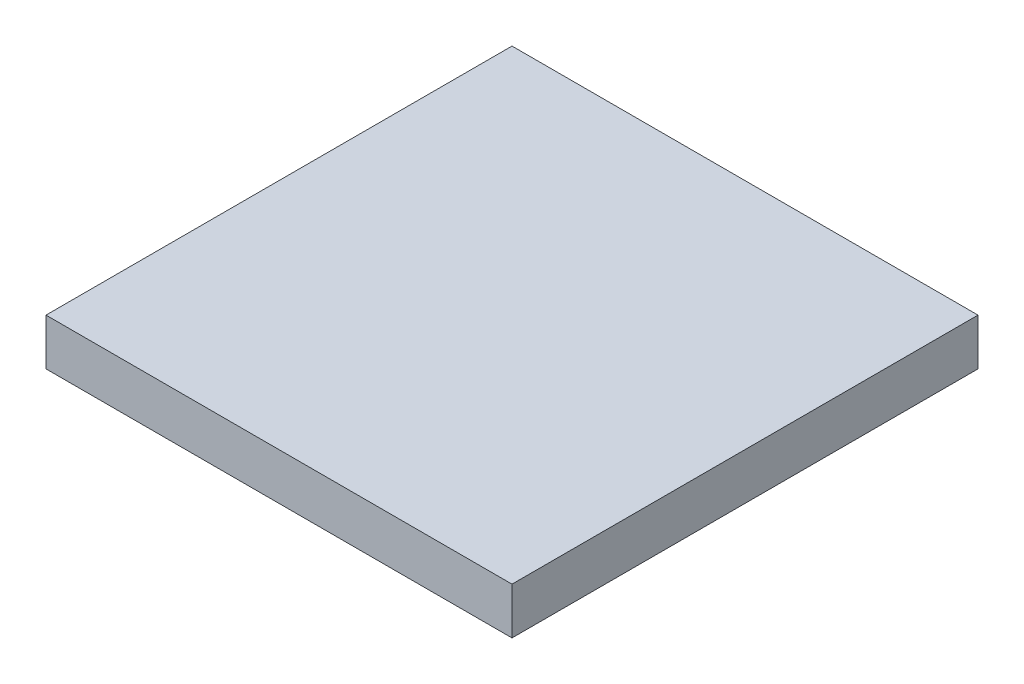
ISO-10303-21;
HEADER;
FILE_DESCRIPTION(('STEP AP214'),'2;1');
FILE_NAME('part.step','',(''),(''),'','','');
FILE_SCHEMA(('AUTOMOTIVE_DESIGN { 1 0 10303 214 1 1 1 1 }'));
ENDSEC;
DATA;
#1=APPLICATION_CONTEXT('core data for automotive mechanical design processes');
#2=APPLICATION_PROTOCOL_DEFINITION('international standard','automotive_design',2000,#1);
#3=PRODUCT_CONTEXT('',#1,'mechanical');
#4=PRODUCT('Part','Part','',(#3));
#5=PRODUCT_RELATED_PRODUCT_CATEGORY('part','',(#4));
#6=PRODUCT_DEFINITION_FORMATION('','',#4);
#7=PRODUCT_DEFINITION_CONTEXT('part definition',#1,'design');
#8=PRODUCT_DEFINITION('design','',#6,#7);
#9=PRODUCT_DEFINITION_SHAPE('','',#8);
#10=(LENGTH_UNIT() NAMED_UNIT(*) SI_UNIT(.MILLI.,.METRE.));
#11=(NAMED_UNIT(*) PLANE_ANGLE_UNIT() SI_UNIT($,.RADIAN.));
#12=(NAMED_UNIT(*) SI_UNIT($,.STERADIAN.) SOLID_ANGLE_UNIT());
#13=UNCERTAINTY_MEASURE_WITH_UNIT(LENGTH_MEASURE(1.E-05),#10,'distance_accuracy_value','');
#14=(GEOMETRIC_REPRESENTATION_CONTEXT(3) GLOBAL_UNCERTAINTY_ASSIGNED_CONTEXT((#13)) GLOBAL_UNIT_ASSIGNED_CONTEXT((#10,
#11,#12)) REPRESENTATION_CONTEXT('',''));
#15=CARTESIAN_POINT('',(0.,0.,0.));
#16=DIRECTION('',(0.,0.,1.));
#17=DIRECTION('',(1.,0.,0.));
#18=AXIS2_PLACEMENT_3D('',#15,#16,#17);
#19=CARTESIAN_POINT('',(0.,10.,0.));
#20=DIRECTION('',(1.,0.,0.));
#21=DIRECTION('',(0.,0.,-1.));
#22=AXIS2_PLACEMENT_3D('',#19,#20,#21);
#23=PLANE('',#22);
#24=DIRECTION('',(0.,0.,1.));
#25=VECTOR('',#24,1.);
#26=CARTESIAN_POINT('',(0.,0.,0.));
#27=LINE('',#26,#25);
#28=CARTESIAN_POINT('',(0.,0.,-100.));
#29=VERTEX_POINT('',#28);
#30=CARTESIAN_POINT('',(0.,0.,0.));
#31=VERTEX_POINT('',#30);
#32=EDGE_CURVE('E98',#29,#31,#27,.T.);
#33=ORIENTED_EDGE('',*,*,#32,.T.);
#34=DIRECTION('',(0.,-1.,0.));
#35=VECTOR('',#34,1.);
#36=CARTESIAN_POINT('',(0.,10.,0.));
#37=LINE('',#36,#35);
#38=CARTESIAN_POINT('',(0.,10.,0.));
#39=VERTEX_POINT('',#38);
#40=EDGE_CURVE('E11',#39,#31,#37,.T.);
#41=ORIENTED_EDGE('',*,*,#40,.F.);
#42=DIRECTION('',(0.,0.,1.));
#43=VECTOR('',#42,1.);
#44=CARTESIAN_POINT('',(0.,10.,0.));
#45=LINE('',#44,#43);
#46=CARTESIAN_POINT('',(0.,10.,-100.));
#47=VERTEX_POINT('',#46);
#48=EDGE_CURVE('E86',#47,#39,#45,.T.);
#49=ORIENTED_EDGE('',*,*,#48,.F.);
#50=DIRECTION('',(0.,-1.,0.));
#51=VECTOR('',#50,1.);
#52=CARTESIAN_POINT('',(0.,10.,-100.));
#53=LINE('',#52,#51);
#54=EDGE_CURVE('E94',#47,#29,#53,.T.);
#55=ORIENTED_EDGE('',*,*,#54,.T.);
#56=EDGE_LOOP('',(#33,#41,#49,#55));
#57=FACE_BOUND('',#56,.T.);
#58=ADVANCED_FACE('F35',(#57),#23,.F.);
#59=CARTESIAN_POINT('',(0.,10.,0.));
#60=DIRECTION('',(0.,0.,-1.));
#61=DIRECTION('',(-1.,0.,0.));
#62=AXIS2_PLACEMENT_3D('',#59,#60,#61);
#63=PLANE('',#62);
#64=DIRECTION('',(1.,0.,0.));
#65=VECTOR('',#64,1.);
#66=CARTESIAN_POINT('',(0.,0.,0.));
#67=LINE('',#66,#65);
#68=CARTESIAN_POINT('',(100.,0.,0.));
#69=VERTEX_POINT('',#68);
#70=EDGE_CURVE('E90',#31,#69,#67,.T.);
#71=ORIENTED_EDGE('',*,*,#70,.T.);
#72=DIRECTION('',(0.,-1.,0.));
#73=VECTOR('',#72,1.);
#74=CARTESIAN_POINT('',(100.,10.,0.));
#75=LINE('',#74,#73);
#76=CARTESIAN_POINT('',(100.,10.,0.));
#77=VERTEX_POINT('',#76);
#78=EDGE_CURVE('E43',#77,#69,#75,.T.);
#79=ORIENTED_EDGE('',*,*,#78,.F.);
#80=DIRECTION('',(1.,0.,0.));
#81=VECTOR('',#80,1.);
#82=CARTESIAN_POINT('',(0.,10.,0.));
#83=LINE('',#82,#81);
#84=EDGE_CURVE('E81',#39,#77,#83,.T.);
#85=ORIENTED_EDGE('',*,*,#84,.F.);
#86=ORIENTED_EDGE('',*,*,#40,.T.);
#87=EDGE_LOOP('',(#71,#79,#85,#86));
#88=FACE_BOUND('',#87,.T.);
#89=ADVANCED_FACE('F89',(#88),#63,.F.);
#90=CARTESIAN_POINT('',(100.,10.,0.));
#91=DIRECTION('',(-1.,0.,0.));
#92=DIRECTION('',(0.,0.,1.));
#93=AXIS2_PLACEMENT_3D('',#90,#91,#92);
#94=PLANE('',#93);
#95=DIRECTION('',(0.,0.,-1.));
#96=VECTOR('',#95,1.);
#97=CARTESIAN_POINT('',(100.,0.,0.));
#98=LINE('',#97,#96);
#99=CARTESIAN_POINT('',(100.,0.,-100.));
#100=VERTEX_POINT('',#99);
#101=EDGE_CURVE('E68',#69,#100,#98,.T.);
#102=ORIENTED_EDGE('',*,*,#101,.T.);
#103=DIRECTION('',(0.,-1.,0.));
#104=VECTOR('',#103,1.);
#105=CARTESIAN_POINT('',(100.,10.,-100.));
#106=LINE('',#105,#104);
#107=CARTESIAN_POINT('',(100.,10.,-100.));
#108=VERTEX_POINT('',#107);
#109=EDGE_CURVE('E91',#108,#100,#106,.T.);
#110=ORIENTED_EDGE('',*,*,#109,.F.);
#111=DIRECTION('',(0.,0.,-1.));
#112=VECTOR('',#111,1.);
#113=CARTESIAN_POINT('',(100.,10.,0.));
#114=LINE('',#113,#112);
#115=EDGE_CURVE('E84',#77,#108,#114,.T.);
#116=ORIENTED_EDGE('',*,*,#115,.F.);
#117=ORIENTED_EDGE('',*,*,#78,.T.);
#118=EDGE_LOOP('',(#102,#110,#116,#117));
#119=FACE_BOUND('',#118,.T.);
#120=ADVANCED_FACE('F92',(#119),#94,.F.);
#121=CARTESIAN_POINT('',(0.,10.,-100.));
#122=DIRECTION('',(0.,0.,1.));
#123=DIRECTION('',(1.,0.,0.));
#124=AXIS2_PLACEMENT_3D('',#121,#122,#123);
#125=PLANE('',#124);
#126=DIRECTION('',(-1.,0.,0.));
#127=VECTOR('',#126,1.);
#128=CARTESIAN_POINT('',(0.,0.,-100.));
#129=LINE('',#128,#127);
#130=EDGE_CURVE('E74',#100,#29,#129,.T.);
#131=ORIENTED_EDGE('',*,*,#130,.T.);
#132=ORIENTED_EDGE('',*,*,#54,.F.);
#133=DIRECTION('',(-1.,0.,0.));
#134=VECTOR('',#133,1.);
#135=CARTESIAN_POINT('',(0.,10.,-100.));
#136=LINE('',#135,#134);
#137=EDGE_CURVE('E51',#108,#47,#136,.T.);
#138=ORIENTED_EDGE('',*,*,#137,.F.);
#139=ORIENTED_EDGE('',*,*,#109,.T.);
#140=EDGE_LOOP('',(#131,#132,#138,#139));
#141=FACE_BOUND('',#140,.T.);
#142=ADVANCED_FACE('F105',(#141),#125,.F.);
#143=CARTESIAN_POINT('',(0.,10.,0.));
#144=DIRECTION('',(0.,-1.,0.));
#145=DIRECTION('',(0.,0.,-1.));
#146=AXIS2_PLACEMENT_3D('',#143,#144,#145);
#147=PLANE('',#146);
#148=ORIENTED_EDGE('',*,*,#48,.T.);
#149=ORIENTED_EDGE('',*,*,#84,.T.);
#150=ORIENTED_EDGE('',*,*,#115,.T.);
#151=ORIENTED_EDGE('',*,*,#137,.T.);
#152=EDGE_LOOP('',(#148,#149,#150,#151));
#153=FACE_BOUND('',#152,.T.);
#154=ADVANCED_FACE('F82',(#153),#147,.F.);
#155=CARTESIAN_POINT('',(0.,0.,0.));
#156=DIRECTION('',(0.,-1.,0.));
#157=DIRECTION('',(0.,0.,-1.));
#158=AXIS2_PLACEMENT_3D('',#155,#156,#157);
#159=PLANE('',#158);
#160=ORIENTED_EDGE('',*,*,#32,.F.);
#161=ORIENTED_EDGE('',*,*,#130,.F.);
#162=ORIENTED_EDGE('',*,*,#101,.F.);
#163=ORIENTED_EDGE('',*,*,#70,.F.);
#164=EDGE_LOOP('',(#160,#161,#162,#163));
#165=FACE_BOUND('',#164,.T.);
#166=ADVANCED_FACE('F108',(#165),#159,.T.);
#167=CLOSED_SHELL('',(#58,#89,#120,#142,#154,#166));
#168=MANIFOLD_SOLID_BREP('B2',#167);
#169=ADVANCED_BREP_SHAPE_REPRESENTATION('',(#18,#168),#14);
#170=SHAPE_DEFINITION_REPRESENTATION(#9,#169);
ENDSEC;
END-ISO-10303-21;
